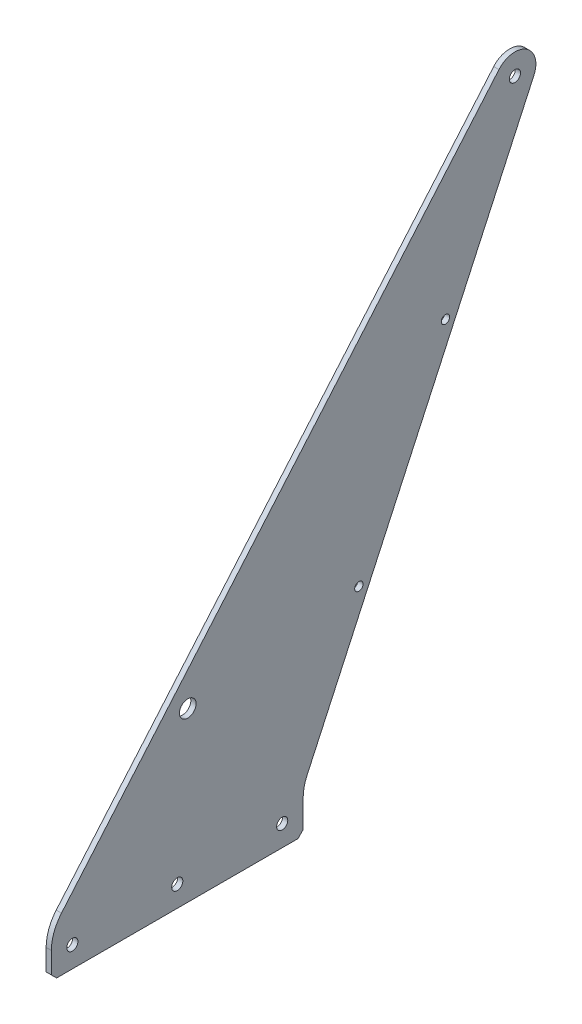
ISO-10303-21;
HEADER;
FILE_DESCRIPTION(('STEP AP214'),'2;1');
FILE_NAME('part.step','',(''),(''),'','','');
FILE_SCHEMA(('AUTOMOTIVE_DESIGN { 1 0 10303 214 1 1 1 1 }'));
ENDSEC;
DATA;
#1=APPLICATION_CONTEXT('core data for automotive mechanical design processes');
#2=APPLICATION_PROTOCOL_DEFINITION('international standard','automotive_design',2000,#1);
#3=PRODUCT_CONTEXT('',#1,'mechanical');
#4=PRODUCT('Part','Part','',(#3));
#5=PRODUCT_RELATED_PRODUCT_CATEGORY('part','',(#4));
#6=PRODUCT_DEFINITION_FORMATION('','',#4);
#7=PRODUCT_DEFINITION_CONTEXT('part definition',#1,'design');
#8=PRODUCT_DEFINITION('design','',#6,#7);
#9=PRODUCT_DEFINITION_SHAPE('','',#8);
#10=(LENGTH_UNIT() NAMED_UNIT(*) SI_UNIT(.MILLI.,.METRE.));
#11=(NAMED_UNIT(*) PLANE_ANGLE_UNIT() SI_UNIT($,.RADIAN.));
#12=(NAMED_UNIT(*) SI_UNIT($,.STERADIAN.) SOLID_ANGLE_UNIT());
#13=UNCERTAINTY_MEASURE_WITH_UNIT(LENGTH_MEASURE(1.E-05),#10,'distance_accuracy_value','');
#14=(GEOMETRIC_REPRESENTATION_CONTEXT(3) GLOBAL_UNCERTAINTY_ASSIGNED_CONTEXT((#13)) GLOBAL_UNIT_ASSIGNED_CONTEXT((#10,
#11,#12)) REPRESENTATION_CONTEXT('',''));
#15=CARTESIAN_POINT('',(0.,0.,0.));
#16=DIRECTION('',(0.,0.,1.));
#17=DIRECTION('',(1.,0.,0.));
#18=AXIS2_PLACEMENT_3D('',#15,#16,#17);
#19=CARTESIAN_POINT('',(3.175,334.069334376424,-280.565394006583));
#20=DIRECTION('',(1.,0.,0.));
#21=DIRECTION('',(0.,0.,-1.));
#22=AXIS2_PLACEMENT_3D('',#19,#20,#21);
#23=PLANE('',#22);
#24=CARTESIAN_POINT('',(3.175,12.7,-12.7));
#25=DIRECTION('',(1.,0.,0.));
#26=DIRECTION('',(0.,0.,-1.));
#27=AXIS2_PLACEMENT_3D('',#24,#25,#26);
#28=CIRCLE('',#27,3.3782);
#29=CARTESIAN_POINT('',(3.175,12.7,-16.0782));
#30=VERTEX_POINT('',#29);
#31=EDGE_CURVE('E345',#30,#30,#28,.T.);
#32=ORIENTED_EDGE('',*,*,#31,.F.);
#33=EDGE_LOOP('',(#32));
#34=FACE_BOUND('',#33,.T.);
#35=CARTESIAN_POINT('',(3.175,12.7,-76.2));
#36=DIRECTION('',(1.,0.,0.));
#37=DIRECTION('',(0.,0.,-1.));
#38=AXIS2_PLACEMENT_3D('',#35,#36,#37);
#39=CIRCLE('',#38,3.37819999999999);
#40=CARTESIAN_POINT('',(3.175,12.7,-79.5782));
#41=VERTEX_POINT('',#40);
#42=EDGE_CURVE('E337',#41,#41,#39,.T.);
#43=ORIENTED_EDGE('',*,*,#42,.F.);
#44=EDGE_LOOP('',(#43));
#45=FACE_BOUND('',#44,.T.);
#46=CARTESIAN_POINT('',(3.175,12.7,-139.7));
#47=DIRECTION('',(1.,0.,0.));
#48=DIRECTION('',(0.,0.,-1.));
#49=AXIS2_PLACEMENT_3D('',#46,#47,#48);
#50=CIRCLE('',#49,3.37819999999999);
#51=CARTESIAN_POINT('',(3.175,12.7,-143.0782));
#52=VERTEX_POINT('',#51);
#53=EDGE_CURVE('E329',#52,#52,#50,.T.);
#54=ORIENTED_EDGE('',*,*,#53,.F.);
#55=EDGE_LOOP('',(#54));
#56=FACE_BOUND('',#55,.T.);
#57=CARTESIAN_POINT('',(3.175,227.602177824098,-238.526483092302));
#58=DIRECTION('',(1.,0.,0.));
#59=DIRECTION('',(0.,0.,-1.));
#60=AXIS2_PLACEMENT_3D('',#57,#58,#59);
#61=CIRCLE('',#60,2.54000000000001);
#62=CARTESIAN_POINT('',(3.175,227.602177824098,-241.066483092302));
#63=VERTEX_POINT('',#62);
#64=EDGE_CURVE('E321',#63,#63,#61,.T.);
#65=ORIENTED_EDGE('',*,*,#64,.F.);
#66=EDGE_LOOP('',(#65));
#67=FACE_BOUND('',#66,.T.);
#68=CARTESIAN_POINT('',(3.175,113.801088912049,-186.119185797151));
#69=DIRECTION('',(1.,0.,0.));
#70=DIRECTION('',(0.,0.,-1.));
#71=AXIS2_PLACEMENT_3D('',#68,#69,#70);
#72=CIRCLE('',#71,2.53999999999998);
#73=CARTESIAN_POINT('',(3.175,113.801088912049,-188.659185797151));
#74=VERTEX_POINT('',#73);
#75=EDGE_CURVE('E314',#74,#74,#72,.T.);
#76=ORIENTED_EDGE('',*,*,#75,.F.);
#77=EDGE_LOOP('',(#76));
#78=FACE_BOUND('',#77,.T.);
#79=CARTESIAN_POINT('',(3.175,101.6,-82.55));
#80=DIRECTION('',(1.,0.,0.));
#81=DIRECTION('',(0.,0.,-1.));
#82=AXIS2_PLACEMENT_3D('',#79,#80,#81);
#83=CIRCLE('',#82,5.0419);
#84=CARTESIAN_POINT('',(3.175,101.6,-87.5919));
#85=VERTEX_POINT('',#84);
#86=EDGE_CURVE('E168',#85,#85,#83,.T.);
#87=ORIENTED_EDGE('',*,*,#86,.F.);
#88=EDGE_LOOP('',(#87));
#89=FACE_BOUND('',#88,.T.);
#90=DIRECTION('',(0.,-0.760127220332807,0.649774275351926));
#91=VECTOR('',#90,1.);
#92=CARTESIAN_POINT('',(3.175,25.4,0.));
#93=LINE('',#92,#91);
#94=CARTESIAN_POINT('',(3.175,342.321467673394,-270.911778308356));
#95=VERTEX_POINT('',#94);
#96=CARTESIAN_POINT('',(3.175,32.5275201842003,-6.09276860354671));
#97=VERTEX_POINT('',#96);
#98=EDGE_CURVE('E154',#95,#97,#93,.T.);
#99=ORIENTED_EDGE('',*,*,#98,.T.);
#100=CARTESIAN_POINT('',(3.175,16.0232535902614,-25.4));
#101=DIRECTION('',(1.,0.,0.));
#102=DIRECTION('',(0.,0.,-1.));
#103=AXIS2_PLACEMENT_3D('',#100,#101,#102);
#104=CIRCLE('',#103,25.4);
#105=CARTESIAN_POINT('',(3.175,16.0232535902614,0.));
#106=VERTEX_POINT('',#105);
#107=EDGE_CURVE('E219',#97,#106,#104,.T.);
#108=ORIENTED_EDGE('',*,*,#107,.T.);
#109=DIRECTION('',(0.,-1.,0.));
#110=VECTOR('',#109,1.);
#111=CARTESIAN_POINT('',(3.175,0.,0.));
#112=LINE('',#111,#110);
#113=CARTESIAN_POINT('',(3.175,3.17499999999998,0.));
#114=VERTEX_POINT('',#113);
#115=EDGE_CURVE('E157',#106,#114,#112,.T.);
#116=ORIENTED_EDGE('',*,*,#115,.T.);
#117=DIRECTION('',(0.,0.707106781186548,0.707106781186548));
#118=VECTOR('',#117,1.);
#119=CARTESIAN_POINT('',(3.175,28.3394701849209,25.1644701849209));
#120=LINE('',#119,#118);
#121=CARTESIAN_POINT('',(3.175,0.,-3.17499999999998));
#122=VERTEX_POINT('',#121);
#123=EDGE_CURVE('E200',#114,#122,#120,.F.);
#124=ORIENTED_EDGE('',*,*,#123,.T.);
#125=DIRECTION('',(0.,0.,-1.));
#126=VECTOR('',#125,1.);
#127=CARTESIAN_POINT('',(3.175,0.,0.));
#128=LINE('',#127,#126);
#129=CARTESIAN_POINT('',(3.175,0.,-149.225));
#130=VERTEX_POINT('',#129);
#131=EDGE_CURVE('E181',#122,#130,#128,.T.);
#132=ORIENTED_EDGE('',*,*,#131,.T.);
#133=DIRECTION('',(0.,-0.707106781186548,0.707106781186548));
#134=VECTOR('',#133,1.);
#135=CARTESIAN_POINT('',(3.175,232.704864191504,-381.929864191503));
#136=LINE('',#135,#134);
#137=CARTESIAN_POINT('',(3.175,3.17500000000004,-152.4));
#138=VERTEX_POINT('',#137);
#139=EDGE_CURVE('E198',#130,#138,#136,.F.);
#140=ORIENTED_EDGE('',*,*,#139,.T.);
#141=DIRECTION('',(0.,1.,0.));
#142=VECTOR('',#141,1.);
#143=CARTESIAN_POINT('',(3.175,0.,-152.4));
#144=LINE('',#143,#142);
#145=CARTESIAN_POINT('',(3.175,19.8324415828596,-152.4));
#146=VERTEX_POINT('',#145);
#147=EDGE_CURVE('E140',#138,#146,#144,.T.);
#148=ORIENTED_EDGE('',*,*,#147,.T.);
#149=CARTESIAN_POINT('',(3.175,19.8324415828596,-177.8));
#150=DIRECTION('',(1.,0.,0.));
#151=DIRECTION('',(0.,0.,-1.));
#152=AXIS2_PLACEMENT_3D('',#149,#150,#151);
#153=CIRCLE('',#152,25.4);
#154=CARTESIAN_POINT('',(3.175,30.4570812273082,-154.728870152816));
#155=VERTEX_POINT('',#154);
#156=EDGE_CURVE('E11',#146,#155,#153,.F.);
#157=ORIENTED_EDGE('',*,*,#156,.T.);
#158=DIRECTION('',(0.,0.90831219870802,-0.418292899387741));
#159=VECTOR('',#158,1.);
#160=CARTESIAN_POINT('',(3.175,25.4,-152.4));
#161=LINE('',#160,#159);
#162=CARTESIAN_POINT('',(3.175,328.7570145542,-292.100958930174));
#163=VERTEX_POINT('',#162);
#164=EDGE_CURVE('E128',#155,#163,#161,.T.);
#165=ORIENTED_EDGE('',*,*,#164,.T.);
#166=CARTESIAN_POINT('',(3.175,334.069334376424,-280.565394006583));
#167=DIRECTION('',(1.,0.,0.));
#168=DIRECTION('',(0.,0.,-1.));
#169=AXIS2_PLACEMENT_3D('',#166,#167,#168);
#170=CIRCLE('',#169,12.7);
#171=EDGE_CURVE('E132',#163,#95,#170,.T.);
#172=ORIENTED_EDGE('',*,*,#171,.T.);
#173=EDGE_LOOP('',(#99,#108,#116,#124,#132,#140,#148,#157,#165,#172));
#174=FACE_BOUND('',#173,.T.);
#175=CARTESIAN_POINT('',(3.175,334.069334376424,-280.565394006583));
#176=DIRECTION('',(1.,0.,0.));
#177=DIRECTION('',(0.,0.,-1.));
#178=AXIS2_PLACEMENT_3D('',#175,#176,#177);
#179=CIRCLE('',#178,3.37819999999999);
#180=CARTESIAN_POINT('',(3.175,334.069334376424,-283.943594006583));
#181=VERTEX_POINT('',#180);
#182=EDGE_CURVE('E304',#181,#181,#179,.T.);
#183=ORIENTED_EDGE('',*,*,#182,.F.);
#184=EDGE_LOOP('',(#183));
#185=FACE_BOUND('',#184,.T.);
#186=ADVANCED_FACE('F40',(#34,#45,#56,#67,#78,#89,#174,#185),#23,.T.);
#187=CARTESIAN_POINT('',(0.,334.069334376424,-280.565394006583));
#188=DIRECTION('',(1.,0.,0.));
#189=DIRECTION('',(0.,0.,-1.));
#190=AXIS2_PLACEMENT_3D('',#187,#188,#189);
#191=PLANE('',#190);
#192=CARTESIAN_POINT('',(0.,12.7,-12.7));
#193=DIRECTION('',(1.,0.,0.));
#194=DIRECTION('',(0.,0.,-1.));
#195=AXIS2_PLACEMENT_3D('',#192,#193,#194);
#196=CIRCLE('',#195,3.3782);
#197=CARTESIAN_POINT('',(0.,12.7,-16.0782));
#198=VERTEX_POINT('',#197);
#199=EDGE_CURVE('E311',#198,#198,#196,.T.);
#200=ORIENTED_EDGE('',*,*,#199,.T.);
#201=EDGE_LOOP('',(#200));
#202=FACE_BOUND('',#201,.T.);
#203=CARTESIAN_POINT('',(0.,12.7,-76.2));
#204=DIRECTION('',(1.,0.,0.));
#205=DIRECTION('',(0.,0.,-1.));
#206=AXIS2_PLACEMENT_3D('',#203,#204,#205);
#207=CIRCLE('',#206,3.37819999999999);
#208=CARTESIAN_POINT('',(0.,12.7,-79.5782));
#209=VERTEX_POINT('',#208);
#210=EDGE_CURVE('E341',#209,#209,#207,.T.);
#211=ORIENTED_EDGE('',*,*,#210,.T.);
#212=EDGE_LOOP('',(#211));
#213=FACE_BOUND('',#212,.T.);
#214=CARTESIAN_POINT('',(0.,12.7,-139.7));
#215=DIRECTION('',(1.,0.,0.));
#216=DIRECTION('',(0.,0.,-1.));
#217=AXIS2_PLACEMENT_3D('',#214,#215,#216);
#218=CIRCLE('',#217,3.37819999999999);
#219=CARTESIAN_POINT('',(0.,12.7,-143.0782));
#220=VERTEX_POINT('',#219);
#221=EDGE_CURVE('E333',#220,#220,#218,.T.);
#222=ORIENTED_EDGE('',*,*,#221,.T.);
#223=EDGE_LOOP('',(#222));
#224=FACE_BOUND('',#223,.T.);
#225=CARTESIAN_POINT('',(0.,227.602177824098,-238.526483092302));
#226=DIRECTION('',(1.,0.,0.));
#227=DIRECTION('',(0.,0.,-1.));
#228=AXIS2_PLACEMENT_3D('',#225,#226,#227);
#229=CIRCLE('',#228,2.54000000000001);
#230=CARTESIAN_POINT('',(0.,227.602177824098,-241.066483092302));
#231=VERTEX_POINT('',#230);
#232=EDGE_CURVE('E325',#231,#231,#229,.T.);
#233=ORIENTED_EDGE('',*,*,#232,.T.);
#234=EDGE_LOOP('',(#233));
#235=FACE_BOUND('',#234,.T.);
#236=CARTESIAN_POINT('',(0.,113.801088912049,-186.119185797151));
#237=DIRECTION('',(1.,0.,0.));
#238=DIRECTION('',(0.,0.,-1.));
#239=AXIS2_PLACEMENT_3D('',#236,#237,#238);
#240=CIRCLE('',#239,2.53999999999998);
#241=CARTESIAN_POINT('',(0.,113.801088912049,-188.659185797151));
#242=VERTEX_POINT('',#241);
#243=EDGE_CURVE('E318',#242,#242,#240,.T.);
#244=ORIENTED_EDGE('',*,*,#243,.T.);
#245=EDGE_LOOP('',(#244));
#246=FACE_BOUND('',#245,.T.);
#247=DIRECTION('',(0.,-1.,0.));
#248=VECTOR('',#247,1.);
#249=CARTESIAN_POINT('',(0.,0.,0.));
#250=LINE('',#249,#248);
#251=CARTESIAN_POINT('',(0.,16.0232535902614,0.));
#252=VERTEX_POINT('',#251);
#253=CARTESIAN_POINT('',(0.,3.17499999999998,0.));
#254=VERTEX_POINT('',#253);
#255=EDGE_CURVE('E178',#252,#254,#250,.T.);
#256=ORIENTED_EDGE('',*,*,#255,.F.);
#257=CARTESIAN_POINT('',(0.,16.0232535902614,-25.4));
#258=DIRECTION('',(1.,0.,0.));
#259=DIRECTION('',(0.,0.,-1.));
#260=AXIS2_PLACEMENT_3D('',#257,#258,#259);
#261=CIRCLE('',#260,25.4);
#262=CARTESIAN_POINT('',(0.,32.5275201842003,-6.09276860354671));
#263=VERTEX_POINT('',#262);
#264=EDGE_CURVE('E69',#252,#263,#261,.F.);
#265=ORIENTED_EDGE('',*,*,#264,.T.);
#266=DIRECTION('',(0.,-0.760127220332807,0.649774275351926));
#267=VECTOR('',#266,1.);
#268=CARTESIAN_POINT('',(0.,25.4,0.));
#269=LINE('',#268,#267);
#270=CARTESIAN_POINT('',(0.,342.321467673394,-270.911778308356));
#271=VERTEX_POINT('',#270);
#272=EDGE_CURVE('E175',#271,#263,#269,.T.);
#273=ORIENTED_EDGE('',*,*,#272,.F.);
#274=CARTESIAN_POINT('',(0.,334.069334376424,-280.565394006583));
#275=DIRECTION('',(1.,0.,0.));
#276=DIRECTION('',(0.,0.,-1.));
#277=AXIS2_PLACEMENT_3D('',#274,#275,#276);
#278=CIRCLE('',#277,12.7);
#279=CARTESIAN_POINT('',(0.,328.7570145542,-292.100958930174));
#280=VERTEX_POINT('',#279);
#281=EDGE_CURVE('E173',#280,#271,#278,.T.);
#282=ORIENTED_EDGE('',*,*,#281,.F.);
#283=DIRECTION('',(0.,0.90831219870802,-0.418292899387741));
#284=VECTOR('',#283,1.);
#285=CARTESIAN_POINT('',(0.,25.4,-152.4));
#286=LINE('',#285,#284);
#287=CARTESIAN_POINT('',(0.,30.4570812273082,-154.728870152816));
#288=VERTEX_POINT('',#287);
#289=EDGE_CURVE('E146',#288,#280,#286,.T.);
#290=ORIENTED_EDGE('',*,*,#289,.F.);
#291=CARTESIAN_POINT('',(0.,19.8324415828596,-177.8));
#292=DIRECTION('',(1.,0.,0.));
#293=DIRECTION('',(0.,0.,-1.));
#294=AXIS2_PLACEMENT_3D('',#291,#292,#293);
#295=CIRCLE('',#294,25.4);
#296=CARTESIAN_POINT('',(0.,19.8324415828596,-152.4));
#297=VERTEX_POINT('',#296);
#298=EDGE_CURVE('E49',#288,#297,#295,.T.);
#299=ORIENTED_EDGE('',*,*,#298,.T.);
#300=DIRECTION('',(0.,1.,0.));
#301=VECTOR('',#300,1.);
#302=CARTESIAN_POINT('',(0.,0.,-152.4));
#303=LINE('',#302,#301);
#304=CARTESIAN_POINT('',(0.,3.17500000000004,-152.4));
#305=VERTEX_POINT('',#304);
#306=EDGE_CURVE('E167',#305,#297,#303,.T.);
#307=ORIENTED_EDGE('',*,*,#306,.F.);
#308=DIRECTION('',(0.,0.707106781186548,-0.707106781186548));
#309=VECTOR('',#308,1.);
#310=CARTESIAN_POINT('',(0.,3.17500000000004,-152.4));
#311=LINE('',#310,#309);
#312=CARTESIAN_POINT('',(0.,0.,-149.225));
#313=VERTEX_POINT('',#312);
#314=EDGE_CURVE('E188',#305,#313,#311,.F.);
#315=ORIENTED_EDGE('',*,*,#314,.T.);
#316=DIRECTION('',(0.,0.,-1.));
#317=VECTOR('',#316,1.);
#318=CARTESIAN_POINT('',(0.,0.,0.));
#319=LINE('',#318,#317);
#320=CARTESIAN_POINT('',(0.,0.,-3.17499999999998));
#321=VERTEX_POINT('',#320);
#322=EDGE_CURVE('E163',#321,#313,#319,.T.);
#323=ORIENTED_EDGE('',*,*,#322,.F.);
#324=DIRECTION('',(0.,-0.707106781186548,-0.707106781186548));
#325=VECTOR('',#324,1.);
#326=CARTESIAN_POINT('',(0.,0.,-3.17499999999998));
#327=LINE('',#326,#325);
#328=EDGE_CURVE('E190',#321,#254,#327,.F.);
#329=ORIENTED_EDGE('',*,*,#328,.T.);
#330=EDGE_LOOP('',(#256,#265,#273,#282,#290,#299,#307,#315,#323,#329));
#331=FACE_BOUND('',#330,.T.);
#332=CARTESIAN_POINT('',(0.,101.6,-82.55));
#333=DIRECTION('',(1.,0.,0.));
#334=DIRECTION('',(0.,0.,-1.));
#335=AXIS2_PLACEMENT_3D('',#332,#333,#334);
#336=CIRCLE('',#335,5.0419);
#337=CARTESIAN_POINT('',(0.,101.6,-87.5919));
#338=VERTEX_POINT('',#337);
#339=EDGE_CURVE('E300',#338,#338,#336,.T.);
#340=ORIENTED_EDGE('',*,*,#339,.T.);
#341=EDGE_LOOP('',(#340));
#342=FACE_BOUND('',#341,.T.);
#343=CARTESIAN_POINT('',(0.,334.069334376424,-280.565394006583));
#344=DIRECTION('',(1.,0.,0.));
#345=DIRECTION('',(0.,0.,-1.));
#346=AXIS2_PLACEMENT_3D('',#343,#344,#345);
#347=CIRCLE('',#346,3.37819999999999);
#348=CARTESIAN_POINT('',(0.,334.069334376424,-283.943594006583));
#349=VERTEX_POINT('',#348);
#350=EDGE_CURVE('E308',#349,#349,#347,.T.);
#351=ORIENTED_EDGE('',*,*,#350,.T.);
#352=EDGE_LOOP('',(#351));
#353=FACE_BOUND('',#352,.T.);
#354=ADVANCED_FACE('F223',(#202,#213,#224,#235,#246,#331,#342,#353),#191,.F.);
#355=CARTESIAN_POINT('',(3.175,0.,0.));
#356=DIRECTION('',(0.,1.,0.));
#357=DIRECTION('',(0.,0.,1.));
#358=AXIS2_PLACEMENT_3D('',#355,#356,#357);
#359=PLANE('',#358);
#360=ORIENTED_EDGE('',*,*,#131,.F.);
#361=DIRECTION('',(-1.,0.,0.));
#362=VECTOR('',#361,1.);
#363=CARTESIAN_POINT('',(3.175,0.,-3.17499999999998));
#364=LINE('',#363,#362);
#365=EDGE_CURVE('E184',#122,#321,#364,.T.);
#366=ORIENTED_EDGE('',*,*,#365,.T.);
#367=ORIENTED_EDGE('',*,*,#322,.T.);
#368=DIRECTION('',(1.,0.,0.));
#369=VECTOR('',#368,1.);
#370=CARTESIAN_POINT('',(3.175,0.,-149.225));
#371=LINE('',#370,#369);
#372=EDGE_CURVE('E149',#313,#130,#371,.T.);
#373=ORIENTED_EDGE('',*,*,#372,.T.);
#374=EDGE_LOOP('',(#360,#366,#367,#373));
#375=FACE_BOUND('',#374,.T.);
#376=ADVANCED_FACE('F247',(#375),#359,.F.);
#377=CARTESIAN_POINT('',(3.175,0.,-152.4));
#378=DIRECTION('',(0.,0.,1.));
#379=DIRECTION('',(1.,0.,0.));
#380=AXIS2_PLACEMENT_3D('',#377,#378,#379);
#381=PLANE('',#380);
#382=ORIENTED_EDGE('',*,*,#306,.T.);
#383=DIRECTION('',(-1.,0.,0.));
#384=VECTOR('',#383,1.);
#385=CARTESIAN_POINT('',(3.175,19.8324415828596,-152.4));
#386=LINE('',#385,#384);
#387=EDGE_CURVE('E209',#297,#146,#386,.F.);
#388=ORIENTED_EDGE('',*,*,#387,.T.);
#389=ORIENTED_EDGE('',*,*,#147,.F.);
#390=DIRECTION('',(-1.,0.,0.));
#391=VECTOR('',#390,1.);
#392=CARTESIAN_POINT('',(3.175,3.17500000000004,-152.4));
#393=LINE('',#392,#391);
#394=EDGE_CURVE('E203',#138,#305,#393,.T.);
#395=ORIENTED_EDGE('',*,*,#394,.T.);
#396=EDGE_LOOP('',(#382,#388,#389,#395));
#397=FACE_BOUND('',#396,.T.);
#398=ADVANCED_FACE('F228',(#397),#381,.F.);
#399=CARTESIAN_POINT('',(3.175,25.4,-152.4));
#400=DIRECTION('',(0.,0.418292899387741,0.90831219870802));
#401=DIRECTION('',(0.,-0.90831219870802,0.418292899387741));
#402=AXIS2_PLACEMENT_3D('',#399,#400,#401);
#403=PLANE('',#402);
#404=ORIENTED_EDGE('',*,*,#164,.F.);
#405=DIRECTION('',(-1.,0.,0.));
#406=VECTOR('',#405,1.);
#407=CARTESIAN_POINT('',(0.,30.4570812273082,-154.728870152816));
#408=LINE('',#407,#406);
#409=EDGE_CURVE('E206',#155,#288,#408,.T.);
#410=ORIENTED_EDGE('',*,*,#409,.T.);
#411=ORIENTED_EDGE('',*,*,#289,.T.);
#412=DIRECTION('',(-1.,0.,0.));
#413=VECTOR('',#412,1.);
#414=CARTESIAN_POINT('',(3.175,328.7570145542,-292.100958930174));
#415=LINE('',#414,#413);
#416=EDGE_CURVE('E143',#163,#280,#415,.T.);
#417=ORIENTED_EDGE('',*,*,#416,.F.);
#418=EDGE_LOOP('',(#404,#410,#411,#417));
#419=FACE_BOUND('',#418,.T.);
#420=ADVANCED_FACE('F144',(#419),#403,.F.);
#421=CARTESIAN_POINT('',(3.175,334.069334376424,-280.565394006583));
#422=DIRECTION('',(-1.,0.,0.));
#423=DIRECTION('',(0.,0.,1.));
#424=AXIS2_PLACEMENT_3D('',#421,#422,#423);
#425=CYLINDRICAL_SURFACE('',#424,12.7);
#426=ORIENTED_EDGE('',*,*,#281,.T.);
#427=DIRECTION('',(-1.,0.,0.));
#428=VECTOR('',#427,1.);
#429=CARTESIAN_POINT('',(3.175,342.321467673394,-270.911778308356));
#430=LINE('',#429,#428);
#431=EDGE_CURVE('E150',#95,#271,#430,.T.);
#432=ORIENTED_EDGE('',*,*,#431,.F.);
#433=ORIENTED_EDGE('',*,*,#171,.F.);
#434=ORIENTED_EDGE('',*,*,#416,.T.);
#435=EDGE_LOOP('',(#426,#432,#433,#434));
#436=FACE_BOUND('',#435,.T.);
#437=ADVANCED_FACE('F152',(#436),#425,.T.);
#438=CARTESIAN_POINT('',(3.175,25.4,0.));
#439=DIRECTION('',(0.,-0.649774275351926,-0.760127220332807));
#440=DIRECTION('',(0.,0.760127220332807,-0.649774275351926));
#441=AXIS2_PLACEMENT_3D('',#438,#439,#440);
#442=PLANE('',#441);
#443=ORIENTED_EDGE('',*,*,#272,.T.);
#444=DIRECTION('',(-1.,0.,0.));
#445=VECTOR('',#444,1.);
#446=CARTESIAN_POINT('',(3.175,32.5275201842003,-6.0927686035467));
#447=LINE('',#446,#445);
#448=EDGE_CURVE('E58',#263,#97,#447,.F.);
#449=ORIENTED_EDGE('',*,*,#448,.T.);
#450=ORIENTED_EDGE('',*,*,#98,.F.);
#451=ORIENTED_EDGE('',*,*,#431,.T.);
#452=EDGE_LOOP('',(#443,#449,#450,#451));
#453=FACE_BOUND('',#452,.T.);
#454=ADVANCED_FACE('F259',(#453),#442,.F.);
#455=CARTESIAN_POINT('',(3.175,0.,0.));
#456=DIRECTION('',(0.,0.,-1.));
#457=DIRECTION('',(-1.,0.,0.));
#458=AXIS2_PLACEMENT_3D('',#455,#456,#457);
#459=PLANE('',#458);
#460=ORIENTED_EDGE('',*,*,#115,.F.);
#461=DIRECTION('',(-1.,0.,0.));
#462=VECTOR('',#461,1.);
#463=CARTESIAN_POINT('',(3.175,16.0232535902614,0.));
#464=LINE('',#463,#462);
#465=EDGE_CURVE('E211',#106,#252,#464,.T.);
#466=ORIENTED_EDGE('',*,*,#465,.T.);
#467=ORIENTED_EDGE('',*,*,#255,.T.);
#468=DIRECTION('',(1.,0.,0.));
#469=VECTOR('',#468,1.);
#470=CARTESIAN_POINT('',(3.175,3.17499999999998,0.));
#471=LINE('',#470,#469);
#472=EDGE_CURVE('E194',#254,#114,#471,.T.);
#473=ORIENTED_EDGE('',*,*,#472,.T.);
#474=EDGE_LOOP('',(#460,#466,#467,#473));
#475=FACE_BOUND('',#474,.T.);
#476=ADVANCED_FACE('F256',(#475),#459,.F.);
#477=CARTESIAN_POINT('',(3.175,101.6,-82.55));
#478=DIRECTION('',(-1.,0.,0.));
#479=DIRECTION('',(0.,0.,1.));
#480=AXIS2_PLACEMENT_3D('',#477,#478,#479);
#481=CYLINDRICAL_SURFACE('',#480,5.0419);
#482=ORIENTED_EDGE('',*,*,#86,.T.);
#483=EDGE_LOOP('',(#482));
#484=FACE_BOUND('',#483,.T.);
#485=ORIENTED_EDGE('',*,*,#339,.F.);
#486=EDGE_LOOP('',(#485));
#487=FACE_BOUND('',#486,.T.);
#488=ADVANCED_FACE('F253',(#484,#487),#481,.F.);
#489=CARTESIAN_POINT('',(3.175,334.069334376424,-280.565394006583));
#490=DIRECTION('',(-1.,0.,0.));
#491=DIRECTION('',(0.,0.,1.));
#492=AXIS2_PLACEMENT_3D('',#489,#490,#491);
#493=CYLINDRICAL_SURFACE('',#492,3.37819999999999);
#494=ORIENTED_EDGE('',*,*,#182,.T.);
#495=EDGE_LOOP('',(#494));
#496=FACE_BOUND('',#495,.T.);
#497=ORIENTED_EDGE('',*,*,#350,.F.);
#498=EDGE_LOOP('',(#497));
#499=FACE_BOUND('',#498,.T.);
#500=ADVANCED_FACE('F366',(#496,#499),#493,.F.);
#501=CARTESIAN_POINT('',(0.,113.801088912049,-186.119185797151));
#502=DIRECTION('',(1.,0.,0.));
#503=DIRECTION('',(0.,0.,-1.));
#504=AXIS2_PLACEMENT_3D('',#501,#502,#503);
#505=CYLINDRICAL_SURFACE('',#504,2.53999999999998);
#506=ORIENTED_EDGE('',*,*,#243,.F.);
#507=EDGE_LOOP('',(#506));
#508=FACE_BOUND('',#507,.T.);
#509=ORIENTED_EDGE('',*,*,#75,.T.);
#510=EDGE_LOOP('',(#509));
#511=FACE_BOUND('',#510,.T.);
#512=ADVANCED_FACE('F362',(#508,#511),#505,.F.);
#513=CARTESIAN_POINT('',(0.,227.602177824098,-238.526483092302));
#514=DIRECTION('',(1.,0.,0.));
#515=DIRECTION('',(0.,0.,-1.));
#516=AXIS2_PLACEMENT_3D('',#513,#514,#515);
#517=CYLINDRICAL_SURFACE('',#516,2.54000000000001);
#518=ORIENTED_EDGE('',*,*,#232,.F.);
#519=EDGE_LOOP('',(#518));
#520=FACE_BOUND('',#519,.T.);
#521=ORIENTED_EDGE('',*,*,#64,.T.);
#522=EDGE_LOOP('',(#521));
#523=FACE_BOUND('',#522,.T.);
#524=ADVANCED_FACE('F365',(#520,#523),#517,.F.);
#525=CARTESIAN_POINT('',(0.,12.7,-139.7));
#526=DIRECTION('',(1.,0.,0.));
#527=DIRECTION('',(0.,0.,-1.));
#528=AXIS2_PLACEMENT_3D('',#525,#526,#527);
#529=CYLINDRICAL_SURFACE('',#528,3.37819999999999);
#530=ORIENTED_EDGE('',*,*,#221,.F.);
#531=EDGE_LOOP('',(#530));
#532=FACE_BOUND('',#531,.T.);
#533=ORIENTED_EDGE('',*,*,#53,.T.);
#534=EDGE_LOOP('',(#533));
#535=FACE_BOUND('',#534,.T.);
#536=ADVANCED_FACE('F386',(#532,#535),#529,.F.);
#537=CARTESIAN_POINT('',(0.,12.7,-76.2));
#538=DIRECTION('',(1.,0.,0.));
#539=DIRECTION('',(0.,0.,-1.));
#540=AXIS2_PLACEMENT_3D('',#537,#538,#539);
#541=CYLINDRICAL_SURFACE('',#540,3.37819999999999);
#542=ORIENTED_EDGE('',*,*,#210,.F.);
#543=EDGE_LOOP('',(#542));
#544=FACE_BOUND('',#543,.T.);
#545=ORIENTED_EDGE('',*,*,#42,.T.);
#546=EDGE_LOOP('',(#545));
#547=FACE_BOUND('',#546,.T.);
#548=ADVANCED_FACE('F284',(#544,#547),#541,.F.);
#549=CARTESIAN_POINT('',(0.,12.7,-12.7));
#550=DIRECTION('',(1.,0.,0.));
#551=DIRECTION('',(0.,0.,-1.));
#552=AXIS2_PLACEMENT_3D('',#549,#550,#551);
#553=CYLINDRICAL_SURFACE('',#552,3.3782);
#554=ORIENTED_EDGE('',*,*,#199,.F.);
#555=EDGE_LOOP('',(#554));
#556=FACE_BOUND('',#555,.T.);
#557=ORIENTED_EDGE('',*,*,#31,.T.);
#558=EDGE_LOOP('',(#557));
#559=FACE_BOUND('',#558,.T.);
#560=ADVANCED_FACE('F277',(#556,#559),#553,.F.);
#561=CARTESIAN_POINT('',(3.175,0.,-3.17499999999998));
#562=DIRECTION('',(0.,0.707106781186548,-0.707106781186548));
#563=DIRECTION('',(-1.,0.,0.));
#564=AXIS2_PLACEMENT_3D('',#561,#562,#563);
#565=PLANE('',#564);
#566=ORIENTED_EDGE('',*,*,#123,.F.);
#567=ORIENTED_EDGE('',*,*,#472,.F.);
#568=ORIENTED_EDGE('',*,*,#328,.F.);
#569=ORIENTED_EDGE('',*,*,#365,.F.);
#570=EDGE_LOOP('',(#566,#567,#568,#569));
#571=FACE_BOUND('',#570,.T.);
#572=ADVANCED_FACE('F239',(#571),#565,.F.);
#573=CARTESIAN_POINT('',(3.175,3.17500000000004,-152.4));
#574=DIRECTION('',(0.,0.707106781186548,0.707106781186548));
#575=DIRECTION('',(-1.,0.,0.));
#576=AXIS2_PLACEMENT_3D('',#573,#574,#575);
#577=PLANE('',#576);
#578=ORIENTED_EDGE('',*,*,#139,.F.);
#579=ORIENTED_EDGE('',*,*,#372,.F.);
#580=ORIENTED_EDGE('',*,*,#314,.F.);
#581=ORIENTED_EDGE('',*,*,#394,.F.);
#582=EDGE_LOOP('',(#578,#579,#580,#581));
#583=FACE_BOUND('',#582,.T.);
#584=ADVANCED_FACE('F233',(#583),#577,.F.);
#585=CARTESIAN_POINT('',(3.175,19.8324415828596,-177.8));
#586=DIRECTION('',(1.,0.,0.));
#587=DIRECTION('',(0.,0.,-1.));
#588=AXIS2_PLACEMENT_3D('',#585,#586,#587);
#589=CYLINDRICAL_SURFACE('',#588,25.4);
#590=ORIENTED_EDGE('',*,*,#156,.F.);
#591=ORIENTED_EDGE('',*,*,#387,.F.);
#592=ORIENTED_EDGE('',*,*,#298,.F.);
#593=ORIENTED_EDGE('',*,*,#409,.F.);
#594=EDGE_LOOP('',(#590,#591,#592,#593));
#595=FACE_BOUND('',#594,.T.);
#596=ADVANCED_FACE('F231',(#595),#589,.F.);
#597=CARTESIAN_POINT('',(3.175,16.0232535902614,-25.4));
#598=DIRECTION('',(-1.,0.,0.));
#599=DIRECTION('',(0.,0.,1.));
#600=AXIS2_PLACEMENT_3D('',#597,#598,#599);
#601=CYLINDRICAL_SURFACE('',#600,25.4);
#602=ORIENTED_EDGE('',*,*,#107,.F.);
#603=ORIENTED_EDGE('',*,*,#448,.F.);
#604=ORIENTED_EDGE('',*,*,#264,.F.);
#605=ORIENTED_EDGE('',*,*,#465,.F.);
#606=EDGE_LOOP('',(#602,#603,#604,#605));
#607=FACE_BOUND('',#606,.T.);
#608=ADVANCED_FACE('F42',(#607),#601,.T.);
#609=CLOSED_SHELL('',(#186,#354,#376,#398,#420,#437,#454,#476,#488,#500,#512,#524,#536,#548,
#560,#572,#584,#596,#608));
#610=MANIFOLD_SOLID_BREP('B2',#609);
#611=ADVANCED_BREP_SHAPE_REPRESENTATION('',(#18,#610),#14);
#612=SHAPE_DEFINITION_REPRESENTATION(#9,#611);
ENDSEC;
END-ISO-10303-21;
